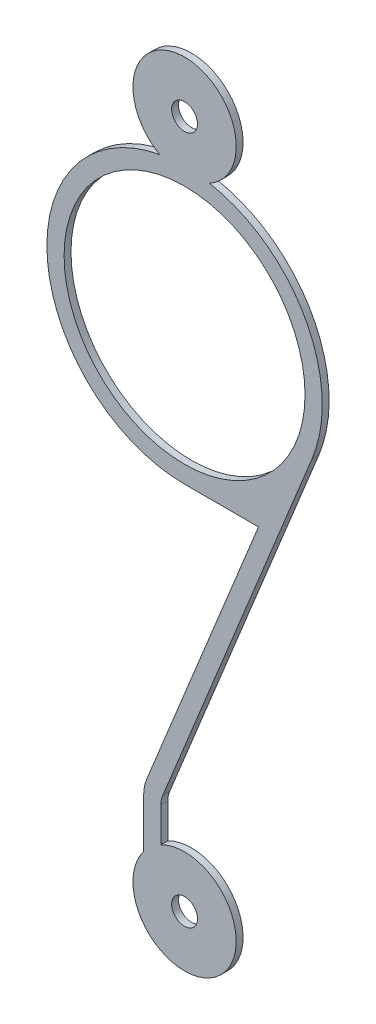
ISO-10303-21;
HEADER;
FILE_DESCRIPTION(('STEP AP214'),'2;1');
FILE_NAME('part.step','',(''),(''),'','','');
FILE_SCHEMA(('AUTOMOTIVE_DESIGN { 1 0 10303 214 1 1 1 1 }'));
ENDSEC;
DATA;
#1=APPLICATION_CONTEXT('core data for automotive mechanical design processes');
#2=APPLICATION_PROTOCOL_DEFINITION('international standard','automotive_design',2000,#1);
#3=PRODUCT_CONTEXT('',#1,'mechanical');
#4=PRODUCT('Part','Part','',(#3));
#5=PRODUCT_RELATED_PRODUCT_CATEGORY('part','',(#4));
#6=PRODUCT_DEFINITION_FORMATION('','',#4);
#7=PRODUCT_DEFINITION_CONTEXT('part definition',#1,'design');
#8=PRODUCT_DEFINITION('design','',#6,#7);
#9=PRODUCT_DEFINITION_SHAPE('','',#8);
#10=(LENGTH_UNIT() NAMED_UNIT(*) SI_UNIT(.MILLI.,.METRE.));
#11=(NAMED_UNIT(*) PLANE_ANGLE_UNIT() SI_UNIT($,.RADIAN.));
#12=(NAMED_UNIT(*) SI_UNIT($,.STERADIAN.) SOLID_ANGLE_UNIT());
#13=UNCERTAINTY_MEASURE_WITH_UNIT(LENGTH_MEASURE(1.E-05),#10,'distance_accuracy_value','');
#14=(GEOMETRIC_REPRESENTATION_CONTEXT(3) GLOBAL_UNCERTAINTY_ASSIGNED_CONTEXT((#13)) GLOBAL_UNIT_ASSIGNED_CONTEXT((#10,
#11,#12)) REPRESENTATION_CONTEXT('',''));
#15=CARTESIAN_POINT('',(0.,0.,0.));
#16=DIRECTION('',(0.,0.,1.));
#17=DIRECTION('',(1.,0.,0.));
#18=AXIS2_PLACEMENT_3D('',#15,#16,#17);
#19=CARTESIAN_POINT('',(0.,4.75,0.1));
#20=DIRECTION('',(0.,0.,1.));
#21=DIRECTION('',(1.,0.,0.));
#22=AXIS2_PLACEMENT_3D('',#19,#20,#21);
#23=PLANE('',#22);
#24=CARTESIAN_POINT('',(0.,10.,0.1));
#25=DIRECTION('',(0.,0.,1.));
#26=DIRECTION('',(1.,0.,0.));
#27=AXIS2_PLACEMENT_3D('',#24,#25,#26);
#28=CIRCLE('',#27,0.375000000000139);
#29=CARTESIAN_POINT('',(0.375000000000209,10.,0.1));
#30=VERTEX_POINT('',#29);
#31=EDGE_CURVE('E273',#30,#30,#28,.T.);
#32=ORIENTED_EDGE('',*,*,#31,.F.);
#33=EDGE_LOOP('',(#32));
#34=FACE_BOUND('',#33,.T.);
#35=CARTESIAN_POINT('',(0.,4.75,0.1));
#36=DIRECTION('',(0.,0.,1.));
#37=DIRECTION('',(1.,0.,0.));
#38=AXIS2_PLACEMENT_3D('',#35,#36,#37);
#39=CIRCLE('',#38,4.);
#40=CARTESIAN_POINT('',(-0.720779017654021,8.68452380952387,0.1));
#41=VERTEX_POINT('',#40);
#42=CARTESIAN_POINT('',(0.,0.750000000000003,0.1));
#43=VERTEX_POINT('',#42);
#44=EDGE_CURVE('E170',#41,#43,#39,.T.);
#45=ORIENTED_EDGE('',*,*,#44,.T.);
#46=DIRECTION('',(1.,0.,0.));
#47=VECTOR('',#46,1.);
#48=CARTESIAN_POINT('',(0.,0.750000000000003,0.1));
#49=LINE('',#48,#47);
#50=CARTESIAN_POINT('',(2.14896592734824,0.75,0.1));
#51=VERTEX_POINT('',#50);
#52=EDGE_CURVE('E103',#43,#51,#49,.T.);
#53=ORIENTED_EDGE('',*,*,#52,.T.);
#54=DIRECTION('',(-0.37751182971274,-0.926004761557379,0.));
#55=VECTOR('',#54,1.);
#56=CARTESIAN_POINT('',(-1.09963065434932,-7.2185341392348,0.1));
#57=LINE('',#56,#55);
#58=CARTESIAN_POINT('',(-1.09963065434933,-7.2185341392348,0.1));
#59=VERTEX_POINT('',#58);
#60=EDGE_CURVE('E194',#51,#59,#57,.T.);
#61=ORIENTED_EDGE('',*,*,#60,.T.);
#62=CARTESIAN_POINT('',(0.,-7.66682943701865,0.1));
#63=DIRECTION('',(0.,0.,1.));
#64=DIRECTION('',(-1.,0.,0.));
#65=AXIS2_PLACEMENT_3D('',#62,#63,#64);
#66=CIRCLE('',#65,1.18749999999999);
#67=CARTESIAN_POINT('',(-1.18749999999994,-7.66682943701866,0.1));
#68=VERTEX_POINT('',#67);
#69=EDGE_CURVE('E213',#59,#68,#66,.T.);
#70=ORIENTED_EDGE('',*,*,#69,.T.);
#71=DIRECTION('',(0.,-1.,0.));
#72=VECTOR('',#71,1.);
#73=CARTESIAN_POINT('',(-1.18749999999994,-7.66682943701866,0.1));
#74=LINE('',#73,#72);
#75=CARTESIAN_POINT('',(-1.18749999999994,-9.08357010633656,0.1));
#76=VERTEX_POINT('',#75);
#77=EDGE_CURVE('E210',#68,#76,#74,.T.);
#78=ORIENTED_EDGE('',*,*,#77,.T.);
#79=CARTESIAN_POINT('',(0.,-10.,0.1));
#80=DIRECTION('',(0.,0.,1.));
#81=DIRECTION('',(1.,0.,0.));
#82=AXIS2_PLACEMENT_3D('',#79,#80,#81);
#83=CIRCLE('',#82,1.5);
#84=CARTESIAN_POINT('',(-0.68749999999994,-8.66682943701866,0.1));
#85=VERTEX_POINT('',#84);
#86=EDGE_CURVE('E212',#76,#85,#83,.T.);
#87=ORIENTED_EDGE('',*,*,#86,.T.);
#88=DIRECTION('',(0.,1.,0.));
#89=VECTOR('',#88,1.);
#90=CARTESIAN_POINT('',(-0.687499999999944,-7.66682943701866,0.1));
#91=LINE('',#90,#89);
#92=CARTESIAN_POINT('',(-0.687499999999942,-7.66682943701866,0.1));
#93=VERTEX_POINT('',#92);
#94=EDGE_CURVE('E215',#85,#93,#91,.T.);
#95=ORIENTED_EDGE('',*,*,#94,.T.);
#96=CARTESIAN_POINT('',(0.,-7.66682943701865,0.1));
#97=DIRECTION('',(0.,0.,-1.));
#98=DIRECTION('',(-1.,0.,0.));
#99=AXIS2_PLACEMENT_3D('',#96,#97,#98);
#100=CIRCLE('',#99,0.687499999999995);
#101=CARTESIAN_POINT('',(-0.636628273570647,-7.40729005409117,0.1));
#102=VERTEX_POINT('',#101);
#103=EDGE_CURVE('E131',#93,#102,#100,.T.);
#104=ORIENTED_EDGE('',*,*,#103,.T.);
#105=DIRECTION('',(0.377511829712741,0.926004761557379,0.));
#106=VECTOR('',#105,1.);
#107=CARTESIAN_POINT('',(-0.636628273570647,-7.40729005409117,0.1));
#108=LINE('',#107,#106);
#109=CARTESIAN_POINT('',(3.7040190462295,3.23995268114904,0.1));
#110=VERTEX_POINT('',#109);
#111=EDGE_CURVE('E125',#102,#110,#108,.T.);
#112=ORIENTED_EDGE('',*,*,#111,.T.);
#113=CARTESIAN_POINT('',(0.,4.75,0.1));
#114=DIRECTION('',(0.,0.,1.));
#115=DIRECTION('',(1.,0.,0.));
#116=AXIS2_PLACEMENT_3D('',#113,#114,#115);
#117=CIRCLE('',#116,4.00000000000001);
#118=CARTESIAN_POINT('',(0.720779017653956,8.68452380952375,0.1));
#119=VERTEX_POINT('',#118);
#120=EDGE_CURVE('E129',#110,#119,#117,.T.);
#121=ORIENTED_EDGE('',*,*,#120,.T.);
#122=CARTESIAN_POINT('',(0.,10.,0.1));
#123=DIRECTION('',(0.,0.,1.));
#124=DIRECTION('',(1.,0.,0.));
#125=AXIS2_PLACEMENT_3D('',#122,#123,#124);
#126=CIRCLE('',#125,1.5);
#127=EDGE_CURVE('E51',#119,#41,#126,.T.);
#128=ORIENTED_EDGE('',*,*,#127,.T.);
#129=EDGE_LOOP('',(#45,#53,#61,#70,#78,#87,#95,#104,#112,#121,#128));
#130=FACE_BOUND('',#129,.T.);
#131=CARTESIAN_POINT('',(0.,-10.,0.1));
#132=DIRECTION('',(0.,0.,1.));
#133=DIRECTION('',(1.,0.,0.));
#134=AXIS2_PLACEMENT_3D('',#131,#132,#133);
#135=CIRCLE('',#134,0.375);
#136=CARTESIAN_POINT('',(0.37500000000007,-10.,0.1));
#137=VERTEX_POINT('',#136);
#138=EDGE_CURVE('E153',#137,#137,#135,.T.);
#139=ORIENTED_EDGE('',*,*,#138,.F.);
#140=EDGE_LOOP('',(#139));
#141=FACE_BOUND('',#140,.T.);
#142=CARTESIAN_POINT('',(0.,4.75,0.1));
#143=DIRECTION('',(0.,0.,1.));
#144=DIRECTION('',(1.,0.,0.));
#145=AXIS2_PLACEMENT_3D('',#142,#143,#144);
#146=CIRCLE('',#145,3.5);
#147=CARTESIAN_POINT('',(3.49999999999996,4.75,0.1));
#148=VERTEX_POINT('',#147);
#149=EDGE_CURVE('E264',#148,#148,#146,.T.);
#150=ORIENTED_EDGE('',*,*,#149,.F.);
#151=EDGE_LOOP('',(#150));
#152=FACE_BOUND('',#151,.T.);
#153=ADVANCED_FACE('F34',(#34,#130,#141,#152),#23,.T.);
#154=CARTESIAN_POINT('',(0.,4.75,-0.1));
#155=DIRECTION('',(0.,0.,1.));
#156=DIRECTION('',(1.,0.,0.));
#157=AXIS2_PLACEMENT_3D('',#154,#155,#156);
#158=PLANE('',#157);
#159=CARTESIAN_POINT('',(0.,4.75,-0.1));
#160=DIRECTION('',(0.,0.,1.));
#161=DIRECTION('',(1.,0.,0.));
#162=AXIS2_PLACEMENT_3D('',#159,#160,#161);
#163=CIRCLE('',#162,4.);
#164=CARTESIAN_POINT('',(-0.720779017654021,8.68452380952387,-0.1));
#165=VERTEX_POINT('',#164);
#166=CARTESIAN_POINT('',(0.,0.750000000000003,-0.1));
#167=VERTEX_POINT('',#166);
#168=EDGE_CURVE('E149',#165,#167,#163,.T.);
#169=ORIENTED_EDGE('',*,*,#168,.F.);
#170=CARTESIAN_POINT('',(0.,10.,-0.1));
#171=DIRECTION('',(0.,0.,1.));
#172=DIRECTION('',(1.,0.,0.));
#173=AXIS2_PLACEMENT_3D('',#170,#171,#172);
#174=CIRCLE('',#173,1.5);
#175=CARTESIAN_POINT('',(0.720779017653956,8.68452380952375,-0.1));
#176=VERTEX_POINT('',#175);
#177=EDGE_CURVE('E95',#176,#165,#174,.T.);
#178=ORIENTED_EDGE('',*,*,#177,.F.);
#179=CARTESIAN_POINT('',(0.,4.75,-0.1));
#180=DIRECTION('',(0.,0.,1.));
#181=DIRECTION('',(1.,0.,0.));
#182=AXIS2_PLACEMENT_3D('',#179,#180,#181);
#183=CIRCLE('',#182,4.00000000000001);
#184=CARTESIAN_POINT('',(3.7040190462295,3.23995268114904,-0.1));
#185=VERTEX_POINT('',#184);
#186=EDGE_CURVE('E89',#185,#176,#183,.T.);
#187=ORIENTED_EDGE('',*,*,#186,.F.);
#188=DIRECTION('',(0.377511829712741,0.926004761557379,0.));
#189=VECTOR('',#188,1.);
#190=CARTESIAN_POINT('',(-0.636628273570647,-7.40729005409117,-0.1));
#191=LINE('',#190,#189);
#192=CARTESIAN_POINT('',(-0.636628273570647,-7.40729005409117,-0.1));
#193=VERTEX_POINT('',#192);
#194=EDGE_CURVE('E139',#193,#185,#191,.T.);
#195=ORIENTED_EDGE('',*,*,#194,.F.);
#196=CARTESIAN_POINT('',(0.,-7.66682943701865,-0.1));
#197=DIRECTION('',(0.,0.,-1.));
#198=DIRECTION('',(-1.,0.,0.));
#199=AXIS2_PLACEMENT_3D('',#196,#197,#198);
#200=CIRCLE('',#199,0.687499999999995);
#201=CARTESIAN_POINT('',(-0.687499999999942,-7.66682943701866,-0.1));
#202=VERTEX_POINT('',#201);
#203=EDGE_CURVE('E165',#202,#193,#200,.T.);
#204=ORIENTED_EDGE('',*,*,#203,.F.);
#205=DIRECTION('',(0.,1.,0.));
#206=VECTOR('',#205,1.);
#207=CARTESIAN_POINT('',(-0.687499999999944,-7.66682943701866,-0.1));
#208=LINE('',#207,#206);
#209=CARTESIAN_POINT('',(-0.68749999999994,-8.66682943701866,-0.1));
#210=VERTEX_POINT('',#209);
#211=EDGE_CURVE('E163',#210,#202,#208,.T.);
#212=ORIENTED_EDGE('',*,*,#211,.F.);
#213=CARTESIAN_POINT('',(0.,-10.,-0.1));
#214=DIRECTION('',(0.,0.,1.));
#215=DIRECTION('',(1.,0.,0.));
#216=AXIS2_PLACEMENT_3D('',#213,#214,#215);
#217=CIRCLE('',#216,1.5);
#218=CARTESIAN_POINT('',(-1.18749999999994,-9.08357010633656,-0.1));
#219=VERTEX_POINT('',#218);
#220=EDGE_CURVE('E161',#219,#210,#217,.T.);
#221=ORIENTED_EDGE('',*,*,#220,.F.);
#222=DIRECTION('',(0.,-1.,0.));
#223=VECTOR('',#222,1.);
#224=CARTESIAN_POINT('',(-1.18749999999994,-7.66682943701866,-0.1));
#225=LINE('',#224,#223);
#226=CARTESIAN_POINT('',(-1.18749999999994,-7.66682943701866,-0.1));
#227=VERTEX_POINT('',#226);
#228=EDGE_CURVE('E159',#227,#219,#225,.T.);
#229=ORIENTED_EDGE('',*,*,#228,.F.);
#230=CARTESIAN_POINT('',(0.,-7.66682943701865,-0.1));
#231=DIRECTION('',(0.,0.,1.));
#232=DIRECTION('',(-1.,0.,0.));
#233=AXIS2_PLACEMENT_3D('',#230,#231,#232);
#234=CIRCLE('',#233,1.18749999999999);
#235=CARTESIAN_POINT('',(-1.09963065434933,-7.2185341392348,-0.1));
#236=VERTEX_POINT('',#235);
#237=EDGE_CURVE('E157',#236,#227,#234,.T.);
#238=ORIENTED_EDGE('',*,*,#237,.F.);
#239=DIRECTION('',(-0.37751182971274,-0.926004761557379,0.));
#240=VECTOR('',#239,1.);
#241=CARTESIAN_POINT('',(-1.09963065434932,-7.2185341392348,-0.1));
#242=LINE('',#241,#240);
#243=CARTESIAN_POINT('',(2.14896592734824,0.75,-0.1));
#244=VERTEX_POINT('',#243);
#245=EDGE_CURVE('E155',#244,#236,#242,.T.);
#246=ORIENTED_EDGE('',*,*,#245,.F.);
#247=DIRECTION('',(1.,0.,0.));
#248=VECTOR('',#247,1.);
#249=CARTESIAN_POINT('',(0.,0.750000000000003,-0.1));
#250=LINE('',#249,#248);
#251=EDGE_CURVE('E152',#167,#244,#250,.T.);
#252=ORIENTED_EDGE('',*,*,#251,.F.);
#253=EDGE_LOOP('',(#169,#178,#187,#195,#204,#212,#221,#229,#238,#246,#252));
#254=FACE_BOUND('',#253,.T.);
#255=CARTESIAN_POINT('',(0.,-10.,-0.1));
#256=DIRECTION('',(0.,0.,1.));
#257=DIRECTION('',(1.,0.,0.));
#258=AXIS2_PLACEMENT_3D('',#255,#256,#257);
#259=CIRCLE('',#258,0.375);
#260=CARTESIAN_POINT('',(0.37500000000007,-10.,-0.1));
#261=VERTEX_POINT('',#260);
#262=EDGE_CURVE('E276',#261,#261,#259,.T.);
#263=ORIENTED_EDGE('',*,*,#262,.T.);
#264=EDGE_LOOP('',(#263));
#265=FACE_BOUND('',#264,.T.);
#266=CARTESIAN_POINT('',(0.,10.,-0.1));
#267=DIRECTION('',(0.,0.,1.));
#268=DIRECTION('',(1.,0.,0.));
#269=AXIS2_PLACEMENT_3D('',#266,#267,#268);
#270=CIRCLE('',#269,0.375000000000139);
#271=CARTESIAN_POINT('',(0.375000000000209,10.,-0.1));
#272=VERTEX_POINT('',#271);
#273=EDGE_CURVE('E270',#272,#272,#270,.T.);
#274=ORIENTED_EDGE('',*,*,#273,.T.);
#275=EDGE_LOOP('',(#274));
#276=FACE_BOUND('',#275,.T.);
#277=CARTESIAN_POINT('',(0.,4.75,-0.1));
#278=DIRECTION('',(0.,0.,1.));
#279=DIRECTION('',(1.,0.,0.));
#280=AXIS2_PLACEMENT_3D('',#277,#278,#279);
#281=CIRCLE('',#280,3.5);
#282=CARTESIAN_POINT('',(3.49999999999996,4.75,-0.1));
#283=VERTEX_POINT('',#282);
#284=EDGE_CURVE('E267',#283,#283,#281,.T.);
#285=ORIENTED_EDGE('',*,*,#284,.T.);
#286=EDGE_LOOP('',(#285));
#287=FACE_BOUND('',#286,.T.);
#288=ADVANCED_FACE('F198',(#254,#265,#276,#287),#158,.F.);
#289=CARTESIAN_POINT('',(0.,4.75,0.1));
#290=DIRECTION('',(0.,0.,-1.));
#291=DIRECTION('',(-1.,0.,0.));
#292=AXIS2_PLACEMENT_3D('',#289,#290,#291);
#293=CYLINDRICAL_SURFACE('',#292,4.);
#294=ORIENTED_EDGE('',*,*,#168,.T.);
#295=DIRECTION('',(0.,0.,-1.));
#296=VECTOR('',#295,1.);
#297=CARTESIAN_POINT('',(0.,0.750000000000003,0.1));
#298=LINE('',#297,#296);
#299=EDGE_CURVE('E11',#43,#167,#298,.T.);
#300=ORIENTED_EDGE('',*,*,#299,.F.);
#301=ORIENTED_EDGE('',*,*,#44,.F.);
#302=DIRECTION('',(0.,0.,-1.));
#303=VECTOR('',#302,1.);
#304=CARTESIAN_POINT('',(-0.720779017654021,8.68452380952387,0.1));
#305=LINE('',#304,#303);
#306=EDGE_CURVE('E145',#41,#165,#305,.T.);
#307=ORIENTED_EDGE('',*,*,#306,.T.);
#308=EDGE_LOOP('',(#294,#300,#301,#307));
#309=FACE_BOUND('',#308,.T.);
#310=ADVANCED_FACE('F36',(#309),#293,.T.);
#311=CARTESIAN_POINT('',(0.,0.750000000000003,0.1));
#312=DIRECTION('',(0.,1.,0.));
#313=DIRECTION('',(-1.,0.,0.));
#314=AXIS2_PLACEMENT_3D('',#311,#312,#313);
#315=PLANE('',#314);
#316=ORIENTED_EDGE('',*,*,#251,.T.);
#317=DIRECTION('',(0.,0.,-1.));
#318=VECTOR('',#317,1.);
#319=CARTESIAN_POINT('',(2.14896592734824,0.75,0.1));
#320=LINE('',#319,#318);
#321=EDGE_CURVE('E43',#51,#244,#320,.T.);
#322=ORIENTED_EDGE('',*,*,#321,.F.);
#323=ORIENTED_EDGE('',*,*,#52,.F.);
#324=ORIENTED_EDGE('',*,*,#299,.T.);
#325=EDGE_LOOP('',(#316,#322,#323,#324));
#326=FACE_BOUND('',#325,.T.);
#327=ADVANCED_FACE('F368',(#326),#315,.F.);
#328=CARTESIAN_POINT('',(-1.09963065434932,-7.2185341392348,0.1));
#329=DIRECTION('',(0.926004761557379,-0.37751182971274,0.));
#330=DIRECTION('',(0.37751182971274,0.926004761557379,0.));
#331=AXIS2_PLACEMENT_3D('',#328,#329,#330);
#332=PLANE('',#331);
#333=ORIENTED_EDGE('',*,*,#245,.T.);
#334=DIRECTION('',(0.,0.,-1.));
#335=VECTOR('',#334,1.);
#336=CARTESIAN_POINT('',(-1.09963065434933,-7.2185341392348,0.1));
#337=LINE('',#336,#335);
#338=EDGE_CURVE('E186',#59,#236,#337,.T.);
#339=ORIENTED_EDGE('',*,*,#338,.F.);
#340=ORIENTED_EDGE('',*,*,#60,.F.);
#341=ORIENTED_EDGE('',*,*,#321,.T.);
#342=EDGE_LOOP('',(#333,#339,#340,#341));
#343=FACE_BOUND('',#342,.T.);
#344=ADVANCED_FACE('F192',(#343),#332,.F.);
#345=CARTESIAN_POINT('',(0.,-7.66682943701865,0.1));
#346=DIRECTION('',(0.,0.,-1.));
#347=DIRECTION('',(-1.,0.,0.));
#348=AXIS2_PLACEMENT_3D('',#345,#346,#347);
#349=CYLINDRICAL_SURFACE('',#348,1.18749999999999);
#350=ORIENTED_EDGE('',*,*,#237,.T.);
#351=DIRECTION('',(0.,0.,-1.));
#352=VECTOR('',#351,1.);
#353=CARTESIAN_POINT('',(-1.18749999999994,-7.66682943701866,0.1));
#354=LINE('',#353,#352);
#355=EDGE_CURVE('E183',#68,#227,#354,.T.);
#356=ORIENTED_EDGE('',*,*,#355,.F.);
#357=ORIENTED_EDGE('',*,*,#69,.F.);
#358=ORIENTED_EDGE('',*,*,#338,.T.);
#359=EDGE_LOOP('',(#350,#356,#357,#358));
#360=FACE_BOUND('',#359,.T.);
#361=ADVANCED_FACE('F204',(#360),#349,.T.);
#362=CARTESIAN_POINT('',(-1.18749999999994,-7.66682943701866,0.1));
#363=DIRECTION('',(1.,0.,0.));
#364=DIRECTION('',(0.,1.,0.));
#365=AXIS2_PLACEMENT_3D('',#362,#363,#364);
#366=PLANE('',#365);
#367=ORIENTED_EDGE('',*,*,#228,.T.);
#368=DIRECTION('',(0.,0.,-1.));
#369=VECTOR('',#368,1.);
#370=CARTESIAN_POINT('',(-1.18749999999994,-9.08357010633656,0.1));
#371=LINE('',#370,#369);
#372=EDGE_CURVE('E180',#76,#219,#371,.T.);
#373=ORIENTED_EDGE('',*,*,#372,.F.);
#374=ORIENTED_EDGE('',*,*,#77,.F.);
#375=ORIENTED_EDGE('',*,*,#355,.T.);
#376=EDGE_LOOP('',(#367,#373,#374,#375));
#377=FACE_BOUND('',#376,.T.);
#378=ADVANCED_FACE('F208',(#377),#366,.F.);
#379=CARTESIAN_POINT('',(0.,-10.,0.1));
#380=DIRECTION('',(0.,0.,-1.));
#381=DIRECTION('',(-1.,0.,0.));
#382=AXIS2_PLACEMENT_3D('',#379,#380,#381);
#383=CYLINDRICAL_SURFACE('',#382,1.5);
#384=ORIENTED_EDGE('',*,*,#220,.T.);
#385=DIRECTION('',(0.,0.,-1.));
#386=VECTOR('',#385,1.);
#387=CARTESIAN_POINT('',(-0.68749999999994,-8.66682943701866,0.1));
#388=LINE('',#387,#386);
#389=EDGE_CURVE('E177',#85,#210,#388,.T.);
#390=ORIENTED_EDGE('',*,*,#389,.F.);
#391=ORIENTED_EDGE('',*,*,#86,.F.);
#392=ORIENTED_EDGE('',*,*,#372,.T.);
#393=EDGE_LOOP('',(#384,#390,#391,#392));
#394=FACE_BOUND('',#393,.T.);
#395=ADVANCED_FACE('F334',(#394),#383,.T.);
#396=CARTESIAN_POINT('',(-0.687499999999944,-7.66682943701866,0.1));
#397=DIRECTION('',(-1.,0.,0.));
#398=DIRECTION('',(0.,-1.,0.));
#399=AXIS2_PLACEMENT_3D('',#396,#397,#398);
#400=PLANE('',#399);
#401=ORIENTED_EDGE('',*,*,#211,.T.);
#402=DIRECTION('',(0.,0.,-1.));
#403=VECTOR('',#402,1.);
#404=CARTESIAN_POINT('',(-0.687499999999942,-7.66682943701866,0.1));
#405=LINE('',#404,#403);
#406=EDGE_CURVE('E174',#93,#202,#405,.T.);
#407=ORIENTED_EDGE('',*,*,#406,.F.);
#408=ORIENTED_EDGE('',*,*,#94,.F.);
#409=ORIENTED_EDGE('',*,*,#389,.T.);
#410=EDGE_LOOP('',(#401,#407,#408,#409));
#411=FACE_BOUND('',#410,.T.);
#412=ADVANCED_FACE('F224',(#411),#400,.F.);
#413=CARTESIAN_POINT('',(0.,-7.66682943701865,0.1));
#414=DIRECTION('',(0.,0.,-1.));
#415=DIRECTION('',(-1.,0.,0.));
#416=AXIS2_PLACEMENT_3D('',#413,#414,#415);
#417=CYLINDRICAL_SURFACE('',#416,0.687499999999995);
#418=ORIENTED_EDGE('',*,*,#203,.T.);
#419=DIRECTION('',(0.,0.,-1.));
#420=VECTOR('',#419,1.);
#421=CARTESIAN_POINT('',(-0.636628273570647,-7.40729005409117,0.1));
#422=LINE('',#421,#420);
#423=EDGE_CURVE('E140',#102,#193,#422,.T.);
#424=ORIENTED_EDGE('',*,*,#423,.F.);
#425=ORIENTED_EDGE('',*,*,#103,.F.);
#426=ORIENTED_EDGE('',*,*,#406,.T.);
#427=EDGE_LOOP('',(#418,#424,#425,#426));
#428=FACE_BOUND('',#427,.T.);
#429=ADVANCED_FACE('F228',(#428),#417,.F.);
#430=CARTESIAN_POINT('',(-0.636628273570647,-7.40729005409117,0.1));
#431=DIRECTION('',(-0.926004761557379,0.377511829712741,0.));
#432=DIRECTION('',(-0.377511829712741,-0.926004761557379,0.));
#433=AXIS2_PLACEMENT_3D('',#430,#431,#432);
#434=PLANE('',#433);
#435=ORIENTED_EDGE('',*,*,#194,.T.);
#436=DIRECTION('',(0.,0.,-1.));
#437=VECTOR('',#436,1.);
#438=CARTESIAN_POINT('',(3.7040190462295,3.23995268114904,0.1));
#439=LINE('',#438,#437);
#440=EDGE_CURVE('E136',#110,#185,#439,.T.);
#441=ORIENTED_EDGE('',*,*,#440,.F.);
#442=ORIENTED_EDGE('',*,*,#111,.F.);
#443=ORIENTED_EDGE('',*,*,#423,.T.);
#444=EDGE_LOOP('',(#435,#441,#442,#443));
#445=FACE_BOUND('',#444,.T.);
#446=ADVANCED_FACE('F137',(#445),#434,.F.);
#447=CARTESIAN_POINT('',(0.,4.75,0.1));
#448=DIRECTION('',(0.,0.,-1.));
#449=DIRECTION('',(-1.,0.,0.));
#450=AXIS2_PLACEMENT_3D('',#447,#448,#449);
#451=CYLINDRICAL_SURFACE('',#450,4.00000000000001);
#452=ORIENTED_EDGE('',*,*,#186,.T.);
#453=DIRECTION('',(0.,0.,-1.));
#454=VECTOR('',#453,1.);
#455=CARTESIAN_POINT('',(0.720779017653956,8.68452380952375,0.1));
#456=LINE('',#455,#454);
#457=EDGE_CURVE('E141',#119,#176,#456,.T.);
#458=ORIENTED_EDGE('',*,*,#457,.F.);
#459=ORIENTED_EDGE('',*,*,#120,.F.);
#460=ORIENTED_EDGE('',*,*,#440,.T.);
#461=EDGE_LOOP('',(#452,#458,#459,#460));
#462=FACE_BOUND('',#461,.T.);
#463=ADVANCED_FACE('F143',(#462),#451,.T.);
#464=CARTESIAN_POINT('',(0.,10.,0.1));
#465=DIRECTION('',(0.,0.,-1.));
#466=DIRECTION('',(-1.,0.,0.));
#467=AXIS2_PLACEMENT_3D('',#464,#465,#466);
#468=CYLINDRICAL_SURFACE('',#467,1.5);
#469=ORIENTED_EDGE('',*,*,#177,.T.);
#470=ORIENTED_EDGE('',*,*,#306,.F.);
#471=ORIENTED_EDGE('',*,*,#127,.F.);
#472=ORIENTED_EDGE('',*,*,#457,.T.);
#473=EDGE_LOOP('',(#469,#470,#471,#472));
#474=FACE_BOUND('',#473,.T.);
#475=ADVANCED_FACE('F232',(#474),#468,.T.);
#476=CARTESIAN_POINT('',(0.,-10.,0.1));
#477=DIRECTION('',(0.,0.,-1.));
#478=DIRECTION('',(-1.,0.,0.));
#479=AXIS2_PLACEMENT_3D('',#476,#477,#478);
#480=CYLINDRICAL_SURFACE('',#479,0.375);
#481=ORIENTED_EDGE('',*,*,#138,.T.);
#482=EDGE_LOOP('',(#481));
#483=FACE_BOUND('',#482,.T.);
#484=ORIENTED_EDGE('',*,*,#262,.F.);
#485=EDGE_LOOP('',(#484));
#486=FACE_BOUND('',#485,.T.);
#487=ADVANCED_FACE('F234',(#483,#486),#480,.F.);
#488=CARTESIAN_POINT('',(0.,10.,0.1));
#489=DIRECTION('',(0.,0.,-1.));
#490=DIRECTION('',(-1.,0.,0.));
#491=AXIS2_PLACEMENT_3D('',#488,#489,#490);
#492=CYLINDRICAL_SURFACE('',#491,0.375000000000139);
#493=ORIENTED_EDGE('',*,*,#31,.T.);
#494=EDGE_LOOP('',(#493));
#495=FACE_BOUND('',#494,.T.);
#496=ORIENTED_EDGE('',*,*,#273,.F.);
#497=EDGE_LOOP('',(#496));
#498=FACE_BOUND('',#497,.T.);
#499=ADVANCED_FACE('F240',(#495,#498),#492,.F.);
#500=CARTESIAN_POINT('',(0.,4.75,0.1));
#501=DIRECTION('',(0.,0.,-1.));
#502=DIRECTION('',(-1.,0.,0.));
#503=AXIS2_PLACEMENT_3D('',#500,#501,#502);
#504=CYLINDRICAL_SURFACE('',#503,3.5);
#505=ORIENTED_EDGE('',*,*,#149,.T.);
#506=EDGE_LOOP('',(#505));
#507=FACE_BOUND('',#506,.T.);
#508=ORIENTED_EDGE('',*,*,#284,.F.);
#509=EDGE_LOOP('',(#508));
#510=FACE_BOUND('',#509,.T.);
#511=ADVANCED_FACE('F255',(#507,#510),#504,.F.);
#512=CLOSED_SHELL('',(#153,#288,#310,#327,#344,#361,#378,#395,#412,#429,#446,#463,#475,#487,
#499,#511));
#513=MANIFOLD_SOLID_BREP('B2',#512);
#514=ADVANCED_BREP_SHAPE_REPRESENTATION('',(#18,#513),#14);
#515=SHAPE_DEFINITION_REPRESENTATION(#9,#514);
ENDSEC;
END-ISO-10303-21;
